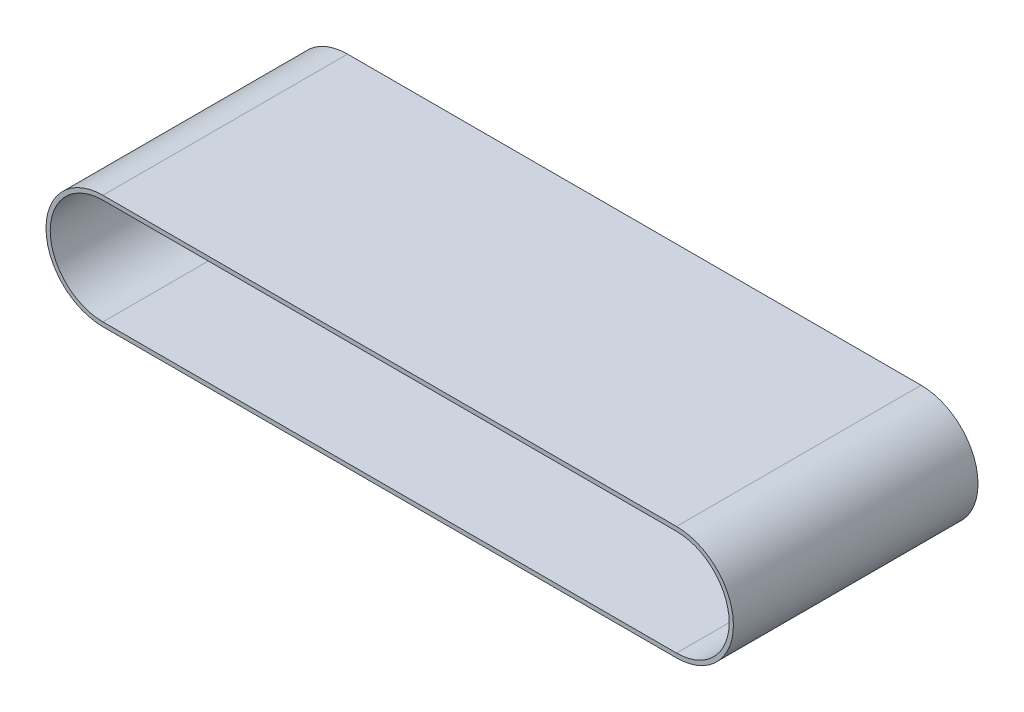
ISO-10303-21;
HEADER;
FILE_DESCRIPTION(('STEP AP214'),'2;1');
FILE_NAME('part.step','',(''),(''),'','','');
FILE_SCHEMA(('AUTOMOTIVE_DESIGN { 1 0 10303 214 1 1 1 1 }'));
ENDSEC;
DATA;
#1=APPLICATION_CONTEXT('core data for automotive mechanical design processes');
#2=APPLICATION_PROTOCOL_DEFINITION('international standard','automotive_design',2000,#1);
#3=PRODUCT_CONTEXT('',#1,'mechanical');
#4=PRODUCT('Part','Part','',(#3));
#5=PRODUCT_RELATED_PRODUCT_CATEGORY('part','',(#4));
#6=PRODUCT_DEFINITION_FORMATION('','',#4);
#7=PRODUCT_DEFINITION_CONTEXT('part definition',#1,'design');
#8=PRODUCT_DEFINITION('design','',#6,#7);
#9=PRODUCT_DEFINITION_SHAPE('','',#8);
#10=(LENGTH_UNIT() NAMED_UNIT(*) SI_UNIT(.MILLI.,.METRE.));
#11=(NAMED_UNIT(*) PLANE_ANGLE_UNIT() SI_UNIT($,.RADIAN.));
#12=(NAMED_UNIT(*) SI_UNIT($,.STERADIAN.) SOLID_ANGLE_UNIT());
#13=UNCERTAINTY_MEASURE_WITH_UNIT(LENGTH_MEASURE(1.E-05),#10,'distance_accuracy_value','');
#14=(GEOMETRIC_REPRESENTATION_CONTEXT(3) GLOBAL_UNCERTAINTY_ASSIGNED_CONTEXT((#13)) GLOBAL_UNIT_ASSIGNED_CONTEXT((#10,
#11,#12)) REPRESENTATION_CONTEXT('',''));
#15=CARTESIAN_POINT('',(0.,0.,0.));
#16=DIRECTION('',(0.,0.,1.));
#17=DIRECTION('',(1.,0.,0.));
#18=AXIS2_PLACEMENT_3D('',#15,#16,#17);
#19=CARTESIAN_POINT('',(52.8413707292242,-1.36293707458859,58.));
#20=DIRECTION('',(0.,0.,-1.));
#21=DIRECTION('',(-1.,0.,0.));
#22=AXIS2_PLACEMENT_3D('',#19,#20,#21);
#23=CYLINDRICAL_SURFACE('',#22,12.5);
#24=CARTESIAN_POINT('',(52.8413707292242,-1.36293707458859,0.));
#25=DIRECTION('',(0.,0.,1.));
#26=DIRECTION('',(1.,0.,0.));
#27=AXIS2_PLACEMENT_3D('',#24,#25,#26);
#28=CIRCLE('',#27,12.5);
#29=CARTESIAN_POINT('',(52.8413707292242,-13.8629370745886,0.));
#30=VERTEX_POINT('',#29);
#31=CARTESIAN_POINT('',(52.8413707292242,11.1370629254114,0.));
#32=VERTEX_POINT('',#31);
#33=EDGE_CURVE('E147',#30,#32,#28,.T.);
#34=ORIENTED_EDGE('',*,*,#33,.F.);
#35=DIRECTION('',(0.,0.,-1.));
#36=VECTOR('',#35,1.);
#37=CARTESIAN_POINT('',(52.8413707292242,-13.8629370745886,58.));
#38=LINE('',#37,#36);
#39=CARTESIAN_POINT('',(52.8413707292242,-13.8629370745886,58.));
#40=VERTEX_POINT('',#39);
#41=EDGE_CURVE('E11',#40,#30,#38,.T.);
#42=ORIENTED_EDGE('',*,*,#41,.F.);
#43=CARTESIAN_POINT('',(52.8413707292242,-1.36293707458859,58.));
#44=DIRECTION('',(0.,0.,1.));
#45=DIRECTION('',(1.,0.,0.));
#46=AXIS2_PLACEMENT_3D('',#43,#44,#45);
#47=CIRCLE('',#46,12.5);
#48=CARTESIAN_POINT('',(52.8413707292242,11.1370629254114,58.));
#49=VERTEX_POINT('',#48);
#50=EDGE_CURVE('E127',#40,#49,#47,.T.);
#51=ORIENTED_EDGE('',*,*,#50,.T.);
#52=DIRECTION('',(0.,0.,-1.));
#53=VECTOR('',#52,1.);
#54=CARTESIAN_POINT('',(52.8413707292242,11.1370629254114,58.));
#55=LINE('',#54,#53);
#56=EDGE_CURVE('E89',#49,#32,#55,.T.);
#57=ORIENTED_EDGE('',*,*,#56,.T.);
#58=EDGE_LOOP('',(#34,#42,#51,#57));
#59=FACE_BOUND('',#58,.T.);
#60=ADVANCED_FACE('F35',(#59),#23,.F.);
#61=CARTESIAN_POINT('',(0.,-13.8629370745886,58.));
#62=DIRECTION('',(0.,1.,0.));
#63=DIRECTION('',(0.,0.,1.));
#64=AXIS2_PLACEMENT_3D('',#61,#62,#63);
#65=PLANE('',#64);
#66=DIRECTION('',(1.,0.,0.));
#67=VECTOR('',#66,1.);
#68=CARTESIAN_POINT('',(0.,-13.8629370745886,0.));
#69=LINE('',#68,#67);
#70=CARTESIAN_POINT('',(-83.1586292707759,-13.8629370745886,0.));
#71=VERTEX_POINT('',#70);
#72=EDGE_CURVE('E117',#71,#30,#69,.T.);
#73=ORIENTED_EDGE('',*,*,#72,.F.);
#74=DIRECTION('',(0.,0.,-1.));
#75=VECTOR('',#74,1.);
#76=CARTESIAN_POINT('',(-83.1586292707759,-13.8629370745886,58.));
#77=LINE('',#76,#75);
#78=CARTESIAN_POINT('',(-83.1586292707759,-13.8629370745886,58.));
#79=VERTEX_POINT('',#78);
#80=EDGE_CURVE('E45',#79,#71,#77,.T.);
#81=ORIENTED_EDGE('',*,*,#80,.F.);
#82=DIRECTION('',(1.,0.,0.));
#83=VECTOR('',#82,1.);
#84=CARTESIAN_POINT('',(0.,-13.8629370745886,58.));
#85=LINE('',#84,#83);
#86=EDGE_CURVE('E115',#79,#40,#85,.T.);
#87=ORIENTED_EDGE('',*,*,#86,.T.);
#88=ORIENTED_EDGE('',*,*,#41,.T.);
#89=EDGE_LOOP('',(#73,#81,#87,#88));
#90=FACE_BOUND('',#89,.T.);
#91=ADVANCED_FACE('F113',(#90),#65,.T.);
#92=CARTESIAN_POINT('',(-83.1586292707759,-1.36293707458859,58.));
#93=DIRECTION('',(0.,0.,-1.));
#94=DIRECTION('',(-1.,0.,0.));
#95=AXIS2_PLACEMENT_3D('',#92,#93,#94);
#96=CYLINDRICAL_SURFACE('',#95,12.5);
#97=CARTESIAN_POINT('',(-83.1586292707759,-1.36293707458859,0.));
#98=DIRECTION('',(0.,0.,1.));
#99=DIRECTION('',(1.,0.,0.));
#100=AXIS2_PLACEMENT_3D('',#97,#98,#99);
#101=CIRCLE('',#100,12.5);
#102=CARTESIAN_POINT('',(-83.1586292707759,11.1370629254114,0.));
#103=VERTEX_POINT('',#102);
#104=EDGE_CURVE('E150',#71,#103,#101,.F.);
#105=ORIENTED_EDGE('',*,*,#104,.T.);
#106=DIRECTION('',(0.,0.,-1.));
#107=VECTOR('',#106,1.);
#108=CARTESIAN_POINT('',(-83.1586292707759,11.1370629254114,58.));
#109=LINE('',#108,#107);
#110=CARTESIAN_POINT('',(-83.1586292707759,11.1370629254114,58.));
#111=VERTEX_POINT('',#110);
#112=EDGE_CURVE('E120',#111,#103,#109,.T.);
#113=ORIENTED_EDGE('',*,*,#112,.F.);
#114=CARTESIAN_POINT('',(-83.1586292707759,-1.36293707458859,58.));
#115=DIRECTION('',(0.,0.,1.));
#116=DIRECTION('',(1.,0.,0.));
#117=AXIS2_PLACEMENT_3D('',#114,#115,#116);
#118=CIRCLE('',#117,12.5);
#119=EDGE_CURVE('E123',#79,#111,#118,.F.);
#120=ORIENTED_EDGE('',*,*,#119,.F.);
#121=ORIENTED_EDGE('',*,*,#80,.T.);
#122=EDGE_LOOP('',(#105,#113,#120,#121));
#123=FACE_BOUND('',#122,.T.);
#124=ADVANCED_FACE('F124',(#123),#96,.F.);
#125=CARTESIAN_POINT('',(52.8413707292242,-1.36293707458859,58.));
#126=DIRECTION('',(0.,0.,-1.));
#127=DIRECTION('',(-1.,0.,0.));
#128=AXIS2_PLACEMENT_3D('',#125,#126,#127);
#129=CYLINDRICAL_SURFACE('',#128,13.5);
#130=CARTESIAN_POINT('',(52.8413707292242,-1.36293707458859,0.));
#131=DIRECTION('',(0.,0.,1.));
#132=DIRECTION('',(1.,0.,0.));
#133=AXIS2_PLACEMENT_3D('',#130,#131,#132);
#134=CIRCLE('',#133,13.5);
#135=CARTESIAN_POINT('',(52.8413707292242,12.1370629254114,0.));
#136=VERTEX_POINT('',#135);
#137=CARTESIAN_POINT('',(52.8413707292242,-14.8629370745886,0.));
#138=VERTEX_POINT('',#137);
#139=EDGE_CURVE('E135',#136,#138,#134,.F.);
#140=ORIENTED_EDGE('',*,*,#139,.F.);
#141=DIRECTION('',(0.,0.,-1.));
#142=VECTOR('',#141,1.);
#143=CARTESIAN_POINT('',(52.8413707292242,12.1370629254114,58.));
#144=LINE('',#143,#142);
#145=CARTESIAN_POINT('',(52.8413707292242,12.1370629254114,58.));
#146=VERTEX_POINT('',#145);
#147=EDGE_CURVE('E39',#146,#136,#144,.T.);
#148=ORIENTED_EDGE('',*,*,#147,.F.);
#149=CARTESIAN_POINT('',(52.8413707292242,-1.36293707458859,58.));
#150=DIRECTION('',(0.,0.,1.));
#151=DIRECTION('',(1.,0.,0.));
#152=AXIS2_PLACEMENT_3D('',#149,#150,#151);
#153=CIRCLE('',#152,13.5);
#154=CARTESIAN_POINT('',(52.8413707292242,-14.8629370745886,58.));
#155=VERTEX_POINT('',#154);
#156=EDGE_CURVE('E153',#146,#155,#153,.F.);
#157=ORIENTED_EDGE('',*,*,#156,.T.);
#158=DIRECTION('',(0.,0.,-1.));
#159=VECTOR('',#158,1.);
#160=CARTESIAN_POINT('',(52.8413707292242,-14.8629370745886,58.));
#161=LINE('',#160,#159);
#162=EDGE_CURVE('E134',#155,#138,#161,.T.);
#163=ORIENTED_EDGE('',*,*,#162,.T.);
#164=EDGE_LOOP('',(#140,#148,#157,#163));
#165=FACE_BOUND('',#164,.T.);
#166=ADVANCED_FACE('F37',(#165),#129,.T.);
#167=CARTESIAN_POINT('',(0.,12.1370629254114,58.));
#168=DIRECTION('',(0.,1.,0.));
#169=DIRECTION('',(0.,0.,1.));
#170=AXIS2_PLACEMENT_3D('',#167,#168,#169);
#171=PLANE('',#170);
#172=DIRECTION('',(1.,0.,0.));
#173=VECTOR('',#172,1.);
#174=CARTESIAN_POINT('',(0.,12.1370629254114,0.));
#175=LINE('',#174,#173);
#176=CARTESIAN_POINT('',(-83.1586292707759,12.1370629254114,0.));
#177=VERTEX_POINT('',#176);
#178=EDGE_CURVE('E138',#177,#136,#175,.T.);
#179=ORIENTED_EDGE('',*,*,#178,.F.);
#180=DIRECTION('',(0.,0.,-1.));
#181=VECTOR('',#180,1.);
#182=CARTESIAN_POINT('',(-83.1586292707759,12.1370629254114,58.));
#183=LINE('',#182,#181);
#184=CARTESIAN_POINT('',(-83.1586292707759,12.1370629254114,58.));
#185=VERTEX_POINT('',#184);
#186=EDGE_CURVE('E158',#185,#177,#183,.T.);
#187=ORIENTED_EDGE('',*,*,#186,.F.);
#188=DIRECTION('',(1.,0.,0.));
#189=VECTOR('',#188,1.);
#190=CARTESIAN_POINT('',(0.,12.1370629254114,58.));
#191=LINE('',#190,#189);
#192=EDGE_CURVE('E167',#185,#146,#191,.T.);
#193=ORIENTED_EDGE('',*,*,#192,.T.);
#194=ORIENTED_EDGE('',*,*,#147,.T.);
#195=EDGE_LOOP('',(#179,#187,#193,#194));
#196=FACE_BOUND('',#195,.T.);
#197=ADVANCED_FACE('F165',(#196),#171,.T.);
#198=CARTESIAN_POINT('',(-83.1586292707759,-1.36293707458859,58.));
#199=DIRECTION('',(0.,0.,-1.));
#200=DIRECTION('',(-1.,0.,0.));
#201=AXIS2_PLACEMENT_3D('',#198,#199,#200);
#202=CYLINDRICAL_SURFACE('',#201,13.5);
#203=CARTESIAN_POINT('',(-83.1586292707759,-1.36293707458859,0.));
#204=DIRECTION('',(0.,0.,1.));
#205=DIRECTION('',(1.,0.,0.));
#206=AXIS2_PLACEMENT_3D('',#203,#204,#205);
#207=CIRCLE('',#206,13.5);
#208=CARTESIAN_POINT('',(-83.1586292707759,-14.8629370745886,0.));
#209=VERTEX_POINT('',#208);
#210=EDGE_CURVE('E141',#177,#209,#207,.T.);
#211=ORIENTED_EDGE('',*,*,#210,.T.);
#212=DIRECTION('',(0.,0.,-1.));
#213=VECTOR('',#212,1.);
#214=CARTESIAN_POINT('',(-83.1586292707759,-14.8629370745886,58.));
#215=LINE('',#214,#213);
#216=CARTESIAN_POINT('',(-83.1586292707759,-14.8629370745886,58.));
#217=VERTEX_POINT('',#216);
#218=EDGE_CURVE('E157',#217,#209,#215,.T.);
#219=ORIENTED_EDGE('',*,*,#218,.F.);
#220=CARTESIAN_POINT('',(-83.1586292707759,-1.36293707458859,58.));
#221=DIRECTION('',(0.,0.,1.));
#222=DIRECTION('',(1.,0.,0.));
#223=AXIS2_PLACEMENT_3D('',#220,#221,#222);
#224=CIRCLE('',#223,13.5);
#225=EDGE_CURVE('E174',#185,#217,#224,.T.);
#226=ORIENTED_EDGE('',*,*,#225,.F.);
#227=ORIENTED_EDGE('',*,*,#186,.T.);
#228=EDGE_LOOP('',(#211,#219,#226,#227));
#229=FACE_BOUND('',#228,.T.);
#230=ADVANCED_FACE('F172',(#229),#202,.T.);
#231=CARTESIAN_POINT('',(0.,-14.8629370745886,58.));
#232=DIRECTION('',(0.,-1.,0.));
#233=DIRECTION('',(1.,0.,0.));
#234=AXIS2_PLACEMENT_3D('',#231,#232,#233);
#235=PLANE('',#234);
#236=DIRECTION('',(-1.,0.,0.));
#237=VECTOR('',#236,1.);
#238=CARTESIAN_POINT('',(0.,-14.8629370745886,0.));
#239=LINE('',#238,#237);
#240=EDGE_CURVE('E144',#138,#209,#239,.T.);
#241=ORIENTED_EDGE('',*,*,#240,.F.);
#242=ORIENTED_EDGE('',*,*,#162,.F.);
#243=DIRECTION('',(-1.,0.,0.));
#244=VECTOR('',#243,1.);
#245=CARTESIAN_POINT('',(0.,-14.8629370745886,58.));
#246=LINE('',#245,#244);
#247=EDGE_CURVE('E129',#155,#217,#246,.T.);
#248=ORIENTED_EDGE('',*,*,#247,.T.);
#249=ORIENTED_EDGE('',*,*,#218,.T.);
#250=EDGE_LOOP('',(#241,#242,#248,#249));
#251=FACE_BOUND('',#250,.T.);
#252=ADVANCED_FACE('F177',(#251),#235,.T.);
#253=CARTESIAN_POINT('',(0.,11.1370629254114,58.));
#254=DIRECTION('',(0.,1.,0.));
#255=DIRECTION('',(0.,0.,1.));
#256=AXIS2_PLACEMENT_3D('',#253,#254,#255);
#257=PLANE('',#256);
#258=DIRECTION('',(1.,0.,0.));
#259=VECTOR('',#258,1.);
#260=CARTESIAN_POINT('',(0.,11.1370629254114,0.));
#261=LINE('',#260,#259);
#262=EDGE_CURVE('E82',#103,#32,#261,.T.);
#263=ORIENTED_EDGE('',*,*,#262,.T.);
#264=ORIENTED_EDGE('',*,*,#56,.F.);
#265=DIRECTION('',(1.,0.,0.));
#266=VECTOR('',#265,1.);
#267=CARTESIAN_POINT('',(0.,11.1370629254114,58.));
#268=LINE('',#267,#266);
#269=EDGE_CURVE('E54',#111,#49,#268,.T.);
#270=ORIENTED_EDGE('',*,*,#269,.F.);
#271=ORIENTED_EDGE('',*,*,#112,.T.);
#272=EDGE_LOOP('',(#263,#264,#270,#271));
#273=FACE_BOUND('',#272,.T.);
#274=ADVANCED_FACE('F183',(#273),#257,.F.);
#275=CARTESIAN_POINT('',(0.,0.,58.));
#276=DIRECTION('',(0.,0.,1.));
#277=DIRECTION('',(1.,0.,0.));
#278=AXIS2_PLACEMENT_3D('',#275,#276,#277);
#279=PLANE('',#278);
#280=ORIENTED_EDGE('',*,*,#156,.F.);
#281=ORIENTED_EDGE('',*,*,#192,.F.);
#282=ORIENTED_EDGE('',*,*,#225,.T.);
#283=ORIENTED_EDGE('',*,*,#247,.F.);
#284=EDGE_LOOP('',(#280,#281,#282,#283));
#285=FACE_BOUND('',#284,.T.);
#286=ORIENTED_EDGE('',*,*,#50,.F.);
#287=ORIENTED_EDGE('',*,*,#86,.F.);
#288=ORIENTED_EDGE('',*,*,#119,.T.);
#289=ORIENTED_EDGE('',*,*,#269,.T.);
#290=EDGE_LOOP('',(#286,#287,#288,#289));
#291=FACE_BOUND('',#290,.T.);
#292=ADVANCED_FACE('F126',(#285,#291),#279,.T.);
#293=CARTESIAN_POINT('',(0.,0.,0.));
#294=DIRECTION('',(0.,0.,1.));
#295=DIRECTION('',(1.,0.,0.));
#296=AXIS2_PLACEMENT_3D('',#293,#294,#295);
#297=PLANE('',#296);
#298=ORIENTED_EDGE('',*,*,#139,.T.);
#299=ORIENTED_EDGE('',*,*,#240,.T.);
#300=ORIENTED_EDGE('',*,*,#210,.F.);
#301=ORIENTED_EDGE('',*,*,#178,.T.);
#302=EDGE_LOOP('',(#298,#299,#300,#301));
#303=FACE_BOUND('',#302,.T.);
#304=ORIENTED_EDGE('',*,*,#33,.T.);
#305=ORIENTED_EDGE('',*,*,#262,.F.);
#306=ORIENTED_EDGE('',*,*,#104,.F.);
#307=ORIENTED_EDGE('',*,*,#72,.T.);
#308=EDGE_LOOP('',(#304,#305,#306,#307));
#309=FACE_BOUND('',#308,.T.);
#310=ADVANCED_FACE('F170',(#303,#309),#297,.F.);
#311=CLOSED_SHELL('',(#60,#91,#124,#166,#197,#230,#252,#274,#292,#310));
#312=MANIFOLD_SOLID_BREP('B2',#311);
#313=ADVANCED_BREP_SHAPE_REPRESENTATION('',(#18,#312),#14);
#314=SHAPE_DEFINITION_REPRESENTATION(#9,#313);
ENDSEC;
END-ISO-10303-21;
